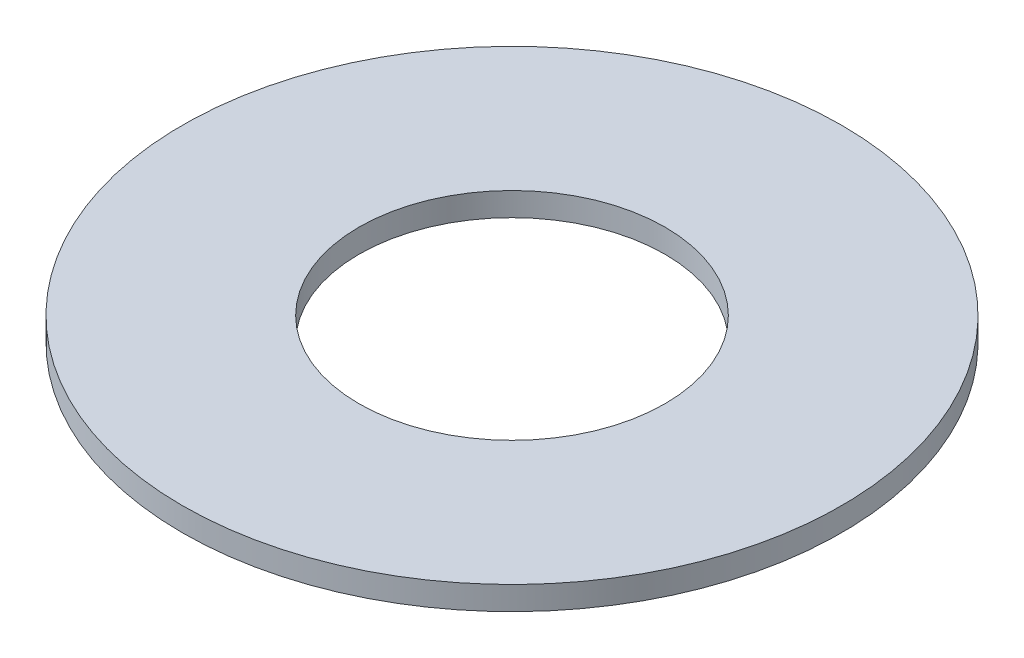
ISO-10303-21;
HEADER;
FILE_DESCRIPTION(('STEP AP214'),'2;1');
FILE_NAME('part.step','',(''),(''),'','','');
FILE_SCHEMA(('AUTOMOTIVE_DESIGN { 1 0 10303 214 1 1 1 1 }'));
ENDSEC;
DATA;
#1=APPLICATION_CONTEXT('core data for automotive mechanical design processes');
#2=APPLICATION_PROTOCOL_DEFINITION('international standard','automotive_design',2000,#1);
#3=PRODUCT_CONTEXT('',#1,'mechanical');
#4=PRODUCT('Part','Part','',(#3));
#5=PRODUCT_RELATED_PRODUCT_CATEGORY('part','',(#4));
#6=PRODUCT_DEFINITION_FORMATION('','',#4);
#7=PRODUCT_DEFINITION_CONTEXT('part definition',#1,'design');
#8=PRODUCT_DEFINITION('design','',#6,#7);
#9=PRODUCT_DEFINITION_SHAPE('','',#8);
#10=(LENGTH_UNIT() NAMED_UNIT(*) SI_UNIT(.MILLI.,.METRE.));
#11=(NAMED_UNIT(*) PLANE_ANGLE_UNIT() SI_UNIT($,.RADIAN.));
#12=(NAMED_UNIT(*) SI_UNIT($,.STERADIAN.) SOLID_ANGLE_UNIT());
#13=UNCERTAINTY_MEASURE_WITH_UNIT(LENGTH_MEASURE(1.E-05),#10,'distance_accuracy_value','');
#14=(GEOMETRIC_REPRESENTATION_CONTEXT(3) GLOBAL_UNCERTAINTY_ASSIGNED_CONTEXT((#13)) GLOBAL_UNIT_ASSIGNED_CONTEXT((#10,
#11,#12)) REPRESENTATION_CONTEXT('',''));
#15=CARTESIAN_POINT('',(0.,0.,0.));
#16=DIRECTION('',(0.,0.,1.));
#17=DIRECTION('',(1.,0.,0.));
#18=AXIS2_PLACEMENT_3D('',#15,#16,#17);
#19=CARTESIAN_POINT('',(0.,5.,0.));
#20=DIRECTION('',(0.,-1.,0.));
#21=DIRECTION('',(0.,0.,-1.));
#22=AXIS2_PLACEMENT_3D('',#19,#20,#21);
#23=CYLINDRICAL_SURFACE('',#22,70.);
#24=CARTESIAN_POINT('',(0.,5.,0.));
#25=DIRECTION('',(0.,1.,0.));
#26=DIRECTION('',(0.,0.,1.));
#27=AXIS2_PLACEMENT_3D('',#24,#25,#26);
#28=CIRCLE('',#27,70.);
#29=CARTESIAN_POINT('',(0.,5.,70.));
#30=VERTEX_POINT('',#29);
#31=EDGE_CURVE('E10',#30,#30,#28,.T.);
#32=ORIENTED_EDGE('',*,*,#31,.F.);
#33=EDGE_LOOP('',(#32));
#34=FACE_BOUND('',#33,.T.);
#35=CARTESIAN_POINT('',(0.,0.,0.));
#36=DIRECTION('',(0.,1.,0.));
#37=DIRECTION('',(0.,0.,1.));
#38=AXIS2_PLACEMENT_3D('',#35,#36,#37);
#39=CIRCLE('',#38,70.);
#40=CARTESIAN_POINT('',(0.,0.,70.));
#41=VERTEX_POINT('',#40);
#42=EDGE_CURVE('E37',#41,#41,#39,.T.);
#43=ORIENTED_EDGE('',*,*,#42,.T.);
#44=EDGE_LOOP('',(#43));
#45=FACE_BOUND('',#44,.T.);
#46=ADVANCED_FACE('F40',(#34,#45),#23,.T.);
#47=CARTESIAN_POINT('',(0.,5.,0.));
#48=DIRECTION('',(0.,1.,0.));
#49=DIRECTION('',(0.,0.,1.));
#50=AXIS2_PLACEMENT_3D('',#47,#48,#49);
#51=PLANE('',#50);
#52=CARTESIAN_POINT('',(0.,5.,0.));
#53=DIRECTION('',(0.,1.,0.));
#54=DIRECTION('',(0.,0.,1.));
#55=AXIS2_PLACEMENT_3D('',#52,#53,#54);
#56=CIRCLE('',#55,32.5);
#57=CARTESIAN_POINT('',(0.,5.,32.5));
#58=VERTEX_POINT('',#57);
#59=EDGE_CURVE('E50',#58,#58,#56,.T.);
#60=ORIENTED_EDGE('',*,*,#59,.F.);
#61=EDGE_LOOP('',(#60));
#62=FACE_BOUND('',#61,.T.);
#63=ORIENTED_EDGE('',*,*,#31,.T.);
#64=EDGE_LOOP('',(#63));
#65=FACE_BOUND('',#64,.T.);
#66=ADVANCED_FACE('F59',(#62,#65),#51,.T.);
#67=CARTESIAN_POINT('',(0.,0.,0.));
#68=DIRECTION('',(0.,1.,0.));
#69=DIRECTION('',(0.,0.,1.));
#70=AXIS2_PLACEMENT_3D('',#67,#68,#69);
#71=PLANE('',#70);
#72=CARTESIAN_POINT('',(0.,0.,0.));
#73=DIRECTION('',(0.,1.,0.));
#74=DIRECTION('',(0.,0.,1.));
#75=AXIS2_PLACEMENT_3D('',#72,#73,#74);
#76=CIRCLE('',#75,32.5);
#77=CARTESIAN_POINT('',(0.,0.,32.5));
#78=VERTEX_POINT('',#77);
#79=EDGE_CURVE('E47',#78,#78,#76,.T.);
#80=ORIENTED_EDGE('',*,*,#79,.T.);
#81=EDGE_LOOP('',(#80));
#82=FACE_BOUND('',#81,.T.);
#83=ORIENTED_EDGE('',*,*,#42,.F.);
#84=EDGE_LOOP('',(#83));
#85=FACE_BOUND('',#84,.T.);
#86=ADVANCED_FACE('F58',(#82,#85),#71,.F.);
#87=CARTESIAN_POINT('',(0.,5.,0.));
#88=DIRECTION('',(0.,-1.,0.));
#89=DIRECTION('',(0.,0.,-1.));
#90=AXIS2_PLACEMENT_3D('',#87,#88,#89);
#91=CYLINDRICAL_SURFACE('',#90,32.5);
#92=ORIENTED_EDGE('',*,*,#59,.T.);
#93=EDGE_LOOP('',(#92));
#94=FACE_BOUND('',#93,.T.);
#95=ORIENTED_EDGE('',*,*,#79,.F.);
#96=EDGE_LOOP('',(#95));
#97=FACE_BOUND('',#96,.T.);
#98=ADVANCED_FACE('F54',(#94,#97),#91,.F.);
#99=CLOSED_SHELL('',(#46,#66,#86,#98));
#100=MANIFOLD_SOLID_BREP('B2',#99);
#101=ADVANCED_BREP_SHAPE_REPRESENTATION('',(#18,#100),#14);
#102=SHAPE_DEFINITION_REPRESENTATION(#9,#101);
ENDSEC;
END-ISO-10303-21;
